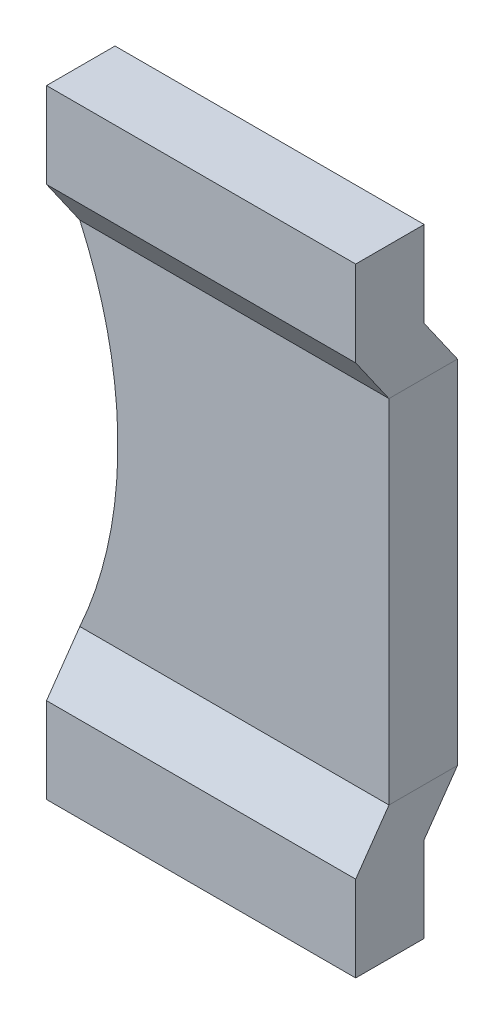
ISO-10303-21;
HEADER;
FILE_DESCRIPTION(('STEP AP214'),'2;1');
FILE_NAME('part.step','',(''),(''),'','','');
FILE_SCHEMA(('AUTOMOTIVE_DESIGN { 1 0 10303 214 1 1 1 1 }'));
ENDSEC;
DATA;
#1=APPLICATION_CONTEXT('core data for automotive mechanical design processes');
#2=APPLICATION_PROTOCOL_DEFINITION('international standard','automotive_design',2000,#1);
#3=PRODUCT_CONTEXT('',#1,'mechanical');
#4=PRODUCT('Part','Part','',(#3));
#5=PRODUCT_RELATED_PRODUCT_CATEGORY('part','',(#4));
#6=PRODUCT_DEFINITION_FORMATION('','',#4);
#7=PRODUCT_DEFINITION_CONTEXT('part definition',#1,'design');
#8=PRODUCT_DEFINITION('design','',#6,#7);
#9=PRODUCT_DEFINITION_SHAPE('','',#8);
#10=(LENGTH_UNIT() NAMED_UNIT(*) SI_UNIT(.MILLI.,.METRE.));
#11=(NAMED_UNIT(*) PLANE_ANGLE_UNIT() SI_UNIT($,.RADIAN.));
#12=(NAMED_UNIT(*) SI_UNIT($,.STERADIAN.) SOLID_ANGLE_UNIT());
#13=UNCERTAINTY_MEASURE_WITH_UNIT(LENGTH_MEASURE(1.E-05),#10,'distance_accuracy_value','');
#14=(GEOMETRIC_REPRESENTATION_CONTEXT(3) GLOBAL_UNCERTAINTY_ASSIGNED_CONTEXT((#13)) GLOBAL_UNIT_ASSIGNED_CONTEXT((#10,
#11,#12)) REPRESENTATION_CONTEXT('',''));
#15=CARTESIAN_POINT('',(0.,0.,0.));
#16=DIRECTION('',(0.,0.,1.));
#17=DIRECTION('',(1.,0.,0.));
#18=AXIS2_PLACEMENT_3D('',#15,#16,#17);
#19=CARTESIAN_POINT('',(-29.0178003146851,-15.9691002559616,-0.547780244336323));
#20=DIRECTION('',(-1.,1.192487681713E-08,4.37114101724698E-08));
#21=DIRECTION('',(1.19248806384999E-08,1.,8.74227339409094E-08));
#22=AXIS2_PLACEMENT_3D('',#19,#20,#21);
#23=PLANE('',#22);
#24=DIRECTION('',(1.53035439237163E-08,-0.819152094432634,0.573576364738498));
#25=VECTOR('',#24,1.);
#26=CARTESIAN_POINT('',(-29.0178003350904,-15.7191743080104,-1.08278022248711));
#27=LINE('',#26,#25);
#28=CARTESIAN_POINT('',(-29.0178003350904,-15.7191743080104,-1.08278022248711));
#29=VERTEX_POINT('',#28);
#30=CARTESIAN_POINT('',(-29.0178003257521,-16.2190261409684,-0.732780266185528));
#31=VERTEX_POINT('',#30);
#32=EDGE_CURVE('P0_E96',#29,#31,#27,.T.);
#33=ORIENTED_EDGE('',*,*,#32,.F.);
#34=DIRECTION('',(-4.37114091299643E-08,8.74227344621626E-08,-1.));
#35=VECTOR('',#34,1.);
#36=CARTESIAN_POINT('',(-29.0178003036182,-15.7191743709548,-0.362780222487118));
#37=LINE('',#36,#35);
#38=CARTESIAN_POINT('',(-29.0178003036182,-15.7191743709548,-0.362780222487118));
#39=VERTEX_POINT('',#38);
#40=EDGE_CURVE('P0_E82',#39,#29,#37,.T.);
#41=ORIENTED_EDGE('',*,*,#40,.F.);
#42=DIRECTION('',(-1.53035439237163E-08,0.819152094432634,-0.573576364738498));
#43=VECTOR('',#42,1.);
#44=CARTESIAN_POINT('',(-29.0178002942799,-16.2190262039127,-0.0127802661855298));
#45=LINE('',#44,#43);
#46=CARTESIAN_POINT('',(-29.0178002942799,-16.2190262039127,-0.0127802661855298));
#47=VERTEX_POINT('',#46);
#48=EDGE_CURVE('P0_E27',#47,#39,#45,.T.);
#49=ORIENTED_EDGE('',*,*,#48,.F.);
#50=DIRECTION('',(1.19248806384999E-08,1.,8.74227339409094E-08));
#51=VECTOR('',#50,1.);
#52=CARTESIAN_POINT('',(-29.0178003050123,-17.1190262039127,-0.0127803448659904));
#53=LINE('',#52,#51);
#54=CARTESIAN_POINT('',(-29.0178003050123,-17.1190262039127,-0.0127803448659904));
#55=VERTEX_POINT('',#54);
#56=EDGE_CURVE('P0_E136',#55,#47,#53,.T.);
#57=ORIENTED_EDGE('',*,*,#56,.F.);
#58=DIRECTION('',(4.37114091299643E-08,-8.74227344621626E-08,1.));
#59=VECTOR('',#58,1.);
#60=CARTESIAN_POINT('',(-29.0178003364845,-17.1190261409684,-0.732780344865988));
#61=LINE('',#60,#59);
#62=CARTESIAN_POINT('',(-29.0178003364845,-17.1190261409684,-0.732780344865988));
#63=VERTEX_POINT('',#62);
#64=EDGE_CURVE('P0_E142',#63,#55,#61,.T.);
#65=ORIENTED_EDGE('',*,*,#64,.F.);
#66=DIRECTION('',(-1.19248806384999E-08,-1.,-8.74227339409094E-08));
#67=VECTOR('',#66,1.);
#68=CARTESIAN_POINT('',(-29.0178003257521,-16.2190261409684,-0.732780266185528));
#69=LINE('',#68,#67);
#70=EDGE_CURVE('P0_E110',#31,#63,#69,.T.);
#71=ORIENTED_EDGE('',*,*,#70,.F.);
#72=EDGE_LOOP('',(#33,#41,#49,#57,#65,#71));
#73=FACE_BOUND('',#72,.T.);
#74=ADVANCED_FACE('P0_F17',(#73),#23,.F.);
#75=CARTESIAN_POINT('',(-32.2678003146851,-15.9691002172057,-0.54778010227424));
#76=DIRECTION('',(-1.,1.192487681713E-08,4.37114101724698E-08));
#77=DIRECTION('',(1.19248806384999E-08,1.,8.74227339409094E-08));
#78=AXIS2_PLACEMENT_3D('',#75,#76,#77);
#79=PLANE('',#78);
#80=DIRECTION('',(-1.53035439237163E-08,0.819152094432634,-0.573576364738498));
#81=VECTOR('',#80,1.);
#82=CARTESIAN_POINT('',(-32.2678002942799,-16.2190261651569,-0.0127801241234468));
#83=LINE('',#82,#81);
#84=CARTESIAN_POINT('',(-32.2678002942799,-16.2190261651569,-0.0127801241234468));
#85=VERTEX_POINT('',#84);
#86=CARTESIAN_POINT('',(-32.2678003036182,-15.7191743321989,-0.362780080425035));
#87=VERTEX_POINT('',#86);
#88=EDGE_CURVE('P0_E11',#85,#87,#83,.T.);
#89=ORIENTED_EDGE('',*,*,#88,.T.);
#90=DIRECTION('',(-4.37114091299643E-08,8.74227344621626E-08,-1.));
#91=VECTOR('',#90,1.);
#92=CARTESIAN_POINT('',(-32.2678003036182,-15.7191743321989,-0.362780080425035));
#93=LINE('',#92,#91);
#94=CARTESIAN_POINT('',(-32.2678003350904,-15.7191742692546,-1.08278008042503));
#95=VERTEX_POINT('',#94);
#96=EDGE_CURVE('P0_E75',#87,#95,#93,.T.);
#97=ORIENTED_EDGE('',*,*,#96,.T.);
#98=DIRECTION('',(1.53035439237163E-08,-0.819152094432634,0.573576364738498));
#99=VECTOR('',#98,1.);
#100=CARTESIAN_POINT('',(-32.2678003350904,-15.7191742692546,-1.08278008042503));
#101=LINE('',#100,#99);
#102=CARTESIAN_POINT('',(-32.2678003257521,-16.2190261022125,-0.732780124123444));
#103=VERTEX_POINT('',#102);
#104=EDGE_CURVE('P0_E63',#95,#103,#101,.T.);
#105=ORIENTED_EDGE('',*,*,#104,.T.);
#106=DIRECTION('',(-1.19248806384999E-08,-1.,-8.74227339409094E-08));
#107=VECTOR('',#106,1.);
#108=CARTESIAN_POINT('',(-32.2678003257521,-16.2190261022125,-0.732780124123444));
#109=LINE('',#108,#107);
#110=CARTESIAN_POINT('',(-32.2678003364844,-17.1190261022126,-0.732780202803905));
#111=VERTEX_POINT('',#110);
#112=EDGE_CURVE('P0_E107',#103,#111,#109,.T.);
#113=ORIENTED_EDGE('',*,*,#112,.T.);
#114=DIRECTION('',(4.37114091299643E-08,-8.74227344621626E-08,1.));
#115=VECTOR('',#114,1.);
#116=CARTESIAN_POINT('',(-32.2678003364844,-17.1190261022126,-0.732780202803905));
#117=LINE('',#116,#115);
#118=CARTESIAN_POINT('',(-32.2678003050123,-17.1190261651569,-0.0127802028039073));
#119=VERTEX_POINT('',#118);
#120=EDGE_CURVE('P0_E113',#111,#119,#117,.T.);
#121=ORIENTED_EDGE('',*,*,#120,.T.);
#122=DIRECTION('',(1.19248806384999E-08,1.,8.74227339409094E-08));
#123=VECTOR('',#122,1.);
#124=CARTESIAN_POINT('',(-32.2678003050123,-17.1190261651569,-0.0127802028039073));
#125=LINE('',#124,#123);
#126=EDGE_CURVE('P0_E100',#119,#85,#125,.T.);
#127=ORIENTED_EDGE('',*,*,#126,.T.);
#128=EDGE_LOOP('',(#89,#97,#105,#113,#121,#127));
#129=FACE_BOUND('',#128,.T.);
#130=ADVANCED_FACE('P0_F77',(#129),#79,.T.);
#131=CARTESIAN_POINT('',(-29.0178002942799,-16.2190262039127,-0.0127802661855298));
#132=DIRECTION('',(4.26461206881058E-08,0.573576364738498,0.819152094432634));
#133=DIRECTION('',(-1.53035439237163E-08,0.819152094432634,-0.573576364738498));
#134=AXIS2_PLACEMENT_3D('',#131,#132,#133);
#135=PLANE('',#134);
#136=ORIENTED_EDGE('',*,*,#48,.T.);
#137=DIRECTION('',(-1.,1.192487681713E-08,4.37114101724698E-08));
#138=VECTOR('',#137,1.);
#139=CARTESIAN_POINT('',(-29.0178003036182,-15.7191743709548,-0.362780222487118));
#140=LINE('',#139,#138);
#141=EDGE_CURVE('P0_E81',#39,#87,#140,.T.);
#142=ORIENTED_EDGE('',*,*,#141,.T.);
#143=ORIENTED_EDGE('',*,*,#88,.F.);
#144=DIRECTION('',(-1.,1.192487681713E-08,4.37114101724698E-08));
#145=VECTOR('',#144,1.);
#146=CARTESIAN_POINT('',(-29.0178002942799,-16.2190262039127,-0.0127802661855298));
#147=LINE('',#146,#145);
#148=EDGE_CURVE('P0_E123',#47,#85,#147,.T.);
#149=ORIENTED_EDGE('',*,*,#148,.F.);
#150=EDGE_LOOP('',(#136,#142,#143,#149));
#151=FACE_BOUND('',#150,.T.);
#152=ADVANCED_FACE('P0_F190',(#151),#135,.T.);
#153=CARTESIAN_POINT('',(-29.0178003036182,-15.7191743709548,-0.362780222487118));
#154=DIRECTION('',(1.19248806384999E-08,1.,8.74227339409094E-08));
#155=DIRECTION('',(-4.37114091299643E-08,8.74227344621626E-08,-1.));
#156=AXIS2_PLACEMENT_3D('',#153,#154,#155);
#157=PLANE('',#156);
#158=ORIENTED_EDGE('',*,*,#40,.T.);
#159=DIRECTION('',(-1.,1.192487681713E-08,4.37114101724698E-08));
#160=VECTOR('',#159,1.);
#161=CARTESIAN_POINT('',(-29.0178003350904,-15.7191743080104,-1.08278022248711));
#162=LINE('',#161,#160);
#163=EDGE_CURVE('P0_E85',#29,#95,#162,.T.);
#164=ORIENTED_EDGE('',*,*,#163,.T.);
#165=ORIENTED_EDGE('',*,*,#96,.F.);
#166=ORIENTED_EDGE('',*,*,#141,.F.);
#167=EDGE_LOOP('',(#158,#164,#165,#166));
#168=FACE_BOUND('',#167,.T.);
#169=ADVANCED_FACE('P0_F86',(#168),#157,.T.);
#170=CARTESIAN_POINT('',(-29.0178003350904,-15.7191743080104,-1.08278022248711));
#171=DIRECTION('',(-4.26461206881058E-08,-0.573576364738498,-0.819152094432634));
#172=DIRECTION('',(1.53035439237163E-08,-0.819152094432634,0.573576364738498));
#173=AXIS2_PLACEMENT_3D('',#170,#171,#172);
#174=PLANE('',#173);
#175=ORIENTED_EDGE('',*,*,#32,.T.);
#176=DIRECTION('',(-1.,1.192487681713E-08,4.37114101724698E-08));
#177=VECTOR('',#176,1.);
#178=CARTESIAN_POINT('',(-29.0178003257521,-16.2190261409684,-0.732780266185528));
#179=LINE('',#178,#177);
#180=EDGE_CURVE('P0_E93',#31,#103,#179,.T.);
#181=ORIENTED_EDGE('',*,*,#180,.T.);
#182=ORIENTED_EDGE('',*,*,#104,.F.);
#183=ORIENTED_EDGE('',*,*,#163,.F.);
#184=EDGE_LOOP('',(#175,#181,#182,#183));
#185=FACE_BOUND('',#184,.T.);
#186=ADVANCED_FACE('P0_F91',(#185),#174,.T.);
#187=CARTESIAN_POINT('',(-29.0178003050123,-17.1190262039127,-0.0127803448659904));
#188=DIRECTION('',(4.37114091299643E-08,-8.74227344621626E-08,1.));
#189=DIRECTION('',(1.19248806384999E-08,1.,8.74227339409094E-08));
#190=AXIS2_PLACEMENT_3D('',#187,#188,#189);
#191=PLANE('',#190);
#192=ORIENTED_EDGE('',*,*,#56,.T.);
#193=ORIENTED_EDGE('',*,*,#148,.T.);
#194=ORIENTED_EDGE('',*,*,#126,.F.);
#195=DIRECTION('',(-1.,1.192487681713E-08,4.37114101724698E-08));
#196=VECTOR('',#195,1.);
#197=CARTESIAN_POINT('',(-29.0178003050123,-17.1190262039127,-0.0127803448659904));
#198=LINE('',#197,#196);
#199=EDGE_CURVE('P0_E118',#55,#119,#198,.T.);
#200=ORIENTED_EDGE('',*,*,#199,.F.);
#201=EDGE_LOOP('',(#192,#193,#194,#200));
#202=FACE_BOUND('',#201,.T.);
#203=ADVANCED_FACE('P0_F186',(#202),#191,.T.);
#204=CARTESIAN_POINT('',(-29.0178003257521,-16.2190261409684,-0.732780266185528));
#205=DIRECTION('',(-4.37114091299643E-08,8.74227344621626E-08,-1.));
#206=DIRECTION('',(-1.19248806384999E-08,-1.,-8.74227339409094E-08));
#207=AXIS2_PLACEMENT_3D('',#204,#205,#206);
#208=PLANE('',#207);
#209=ORIENTED_EDGE('',*,*,#70,.T.);
#210=DIRECTION('',(-1.,1.192487681713E-08,4.37114101724698E-08));
#211=VECTOR('',#210,1.);
#212=CARTESIAN_POINT('',(-29.0178003364845,-17.1190261409684,-0.732780344865988));
#213=LINE('',#212,#211);
#214=EDGE_CURVE('P0_E117',#63,#111,#213,.T.);
#215=ORIENTED_EDGE('',*,*,#214,.T.);
#216=ORIENTED_EDGE('',*,*,#112,.F.);
#217=ORIENTED_EDGE('',*,*,#180,.F.);
#218=EDGE_LOOP('',(#209,#215,#216,#217));
#219=FACE_BOUND('',#218,.T.);
#220=ADVANCED_FACE('P0_F215',(#219),#208,.T.);
#221=CARTESIAN_POINT('',(-29.0178003364845,-17.1190261409684,-0.732780344865988));
#222=DIRECTION('',(-1.19248806384999E-08,-1.,-8.74227339409094E-08));
#223=DIRECTION('',(4.37114091299643E-08,-8.74227344621626E-08,1.));
#224=AXIS2_PLACEMENT_3D('',#221,#222,#223);
#225=PLANE('',#224);
#226=ORIENTED_EDGE('',*,*,#64,.T.);
#227=ORIENTED_EDGE('',*,*,#199,.T.);
#228=ORIENTED_EDGE('',*,*,#120,.F.);
#229=ORIENTED_EDGE('',*,*,#214,.F.);
#230=EDGE_LOOP('',(#226,#227,#228,#229));
#231=FACE_BOUND('',#230,.T.);
#232=ADVANCED_FACE('P0_F194',(#231),#225,.T.);
#233=CLOSED_SHELL('',(#74,#130,#152,#169,#186,#203,#220,#232));
#234=MANIFOLD_SOLID_BREP('P0_B1',#233);
#235=CARTESIAN_POINT('',(-29.0178002645989,-11.7689520583216,-0.547779877147884));
#236=DIRECTION('',(-1.,1.192487681713E-08,4.37114101724698E-08));
#237=DIRECTION('',(1.19248806384999E-08,1.,8.74227339409094E-08));
#238=AXIS2_PLACEMENT_3D('',#235,#236,#237);
#239=PLANE('',#238);
#240=DIRECTION('',(-3.48401246295757E-08,-0.819151994145393,-0.57357650796352));
#241=VECTOR('',#240,1.);
#242=CARTESIAN_POINT('',(-29.0178002697052,-11.5190261409684,-0.732779855298678));
#243=LINE('',#242,#241);
#244=CARTESIAN_POINT('',(-29.0178002697052,-11.5190261409684,-0.732779855298678));
#245=VERTEX_POINT('',#244);
#246=CARTESIAN_POINT('',(-29.0178002909648,-12.0188779127304,-1.08277989899709));
#247=VERTEX_POINT('',#246);
#248=EDGE_CURVE('P1_E27',#245,#247,#243,.T.);
#249=ORIENTED_EDGE('',*,*,#248,.F.);
#250=DIRECTION('',(-1.19248806384999E-08,-1.,-8.74227339409094E-08));
#251=VECTOR('',#250,1.);
#252=CARTESIAN_POINT('',(-29.0178002589727,-10.6190261409684,-0.732779776618218));
#253=LINE('',#252,#251);
#254=CARTESIAN_POINT('',(-29.0178002589727,-10.6190261409684,-0.732779776618218));
#255=VERTEX_POINT('',#254);
#256=EDGE_CURVE('P1_E147',#255,#245,#253,.T.);
#257=ORIENTED_EDGE('',*,*,#256,.F.);
#258=DIRECTION('',(-4.37114091299643E-08,8.74227344621626E-08,-1.));
#259=VECTOR('',#258,1.);
#260=CARTESIAN_POINT('',(-29.0178002275006,-10.6190262039128,-0.0127797766182199));
#261=LINE('',#260,#259);
#262=CARTESIAN_POINT('',(-29.0178002275006,-10.6190262039128,-0.0127797766182199));
#263=VERTEX_POINT('',#262);
#264=EDGE_CURVE('P1_E65',#263,#255,#261,.T.);
#265=ORIENTED_EDGE('',*,*,#264,.F.);
#266=DIRECTION('',(1.19248806384999E-08,1.,8.74227339409094E-08));
#267=VECTOR('',#266,1.);
#268=CARTESIAN_POINT('',(-29.0178002382329,-11.5190262039128,-0.0127798552986805));
#269=LINE('',#268,#267);
#270=CARTESIAN_POINT('',(-29.0178002382329,-11.5190262039128,-0.0127798552986805));
#271=VERTEX_POINT('',#270);
#272=EDGE_CURVE('P1_E157',#271,#263,#269,.T.);
#273=ORIENTED_EDGE('',*,*,#272,.F.);
#274=DIRECTION('',(3.48401246295757E-08,0.819151994145393,0.57357650796352));
#275=VECTOR('',#274,1.);
#276=CARTESIAN_POINT('',(-29.0178002594926,-12.0188779756748,-0.362779898997091));
#277=LINE('',#276,#275);
#278=CARTESIAN_POINT('',(-29.0178002594926,-12.0188779756748,-0.362779898997091));
#279=VERTEX_POINT('',#278);
#280=EDGE_CURVE('P1_E115',#279,#271,#277,.T.);
#281=ORIENTED_EDGE('',*,*,#280,.F.);
#282=DIRECTION('',(4.37114091299643E-08,-8.74227344621626E-08,1.));
#283=VECTOR('',#282,1.);
#284=CARTESIAN_POINT('',(-29.0178002909648,-12.0188779127304,-1.08277989899709));
#285=LINE('',#284,#283);
#286=EDGE_CURVE('P1_E101',#247,#279,#285,.T.);
#287=ORIENTED_EDGE('',*,*,#286,.F.);
#288=EDGE_LOOP('',(#249,#257,#265,#273,#281,#287));
#289=FACE_BOUND('',#288,.T.);
#290=ADVANCED_FACE('P1_F17',(#289),#239,.F.);
#291=CARTESIAN_POINT('',(-32.2678002645988,-11.7689520195658,-0.547779735085801));
#292=DIRECTION('',(-1.,1.192487681713E-08,4.37114101724698E-08));
#293=DIRECTION('',(1.19248806384999E-08,1.,8.74227339409094E-08));
#294=AXIS2_PLACEMENT_3D('',#291,#292,#293);
#295=PLANE('',#294);
#296=DIRECTION('',(-3.48401246295757E-08,-0.819151994145393,-0.57357650796352));
#297=VECTOR('',#296,1.);
#298=CARTESIAN_POINT('',(-32.2678002697051,-11.5190261022126,-0.732779713236595));
#299=LINE('',#298,#297);
#300=CARTESIAN_POINT('',(-32.2678002697051,-11.5190261022126,-0.732779713236595));
#301=VERTEX_POINT('',#300);
#302=CARTESIAN_POINT('',(-32.2678002909648,-12.0188778739746,-1.082779756935));
#303=VERTEX_POINT('',#302);
#304=EDGE_CURVE('P1_E11',#301,#303,#299,.T.);
#305=ORIENTED_EDGE('',*,*,#304,.T.);
#306=DIRECTION('',(4.37114091299643E-08,-8.74227344621626E-08,1.));
#307=VECTOR('',#306,1.);
#308=CARTESIAN_POINT('',(-32.2678002909648,-12.0188778739746,-1.082779756935));
#309=LINE('',#308,#307);
#310=CARTESIAN_POINT('',(-32.2678002594926,-12.018877936919,-0.362779756935007));
#311=VERTEX_POINT('',#310);
#312=EDGE_CURVE('P1_E90',#303,#311,#309,.T.);
#313=ORIENTED_EDGE('',*,*,#312,.T.);
#314=DIRECTION('',(3.48401246295757E-08,0.819151994145393,0.57357650796352));
#315=VECTOR('',#314,1.);
#316=CARTESIAN_POINT('',(-32.2678002594926,-12.018877936919,-0.362779756935007));
#317=LINE('',#316,#315);
#318=CARTESIAN_POINT('',(-32.2678002382329,-11.5190261651569,-0.012779713236597));
#319=VERTEX_POINT('',#318);
#320=EDGE_CURVE('P1_E95',#311,#319,#317,.T.);
#321=ORIENTED_EDGE('',*,*,#320,.T.);
#322=DIRECTION('',(1.19248806384999E-08,1.,8.74227339409094E-08));
#323=VECTOR('',#322,1.);
#324=CARTESIAN_POINT('',(-32.2678002382329,-11.5190261651569,-0.012779713236597));
#325=LINE('',#324,#323);
#326=CARTESIAN_POINT('',(-32.2678002275005,-10.6190261651569,-0.0127796345561369));
#327=VERTEX_POINT('',#326);
#328=EDGE_CURVE('P1_E126',#319,#327,#325,.T.);
#329=ORIENTED_EDGE('',*,*,#328,.T.);
#330=DIRECTION('',(-4.37114091299643E-08,8.74227344621626E-08,-1.));
#331=VECTOR('',#330,1.);
#332=CARTESIAN_POINT('',(-32.2678002275005,-10.6190261651569,-0.0127796345561369));
#333=LINE('',#332,#331);
#334=CARTESIAN_POINT('',(-32.2678002589728,-10.6190261022126,-0.732779634556134));
#335=VERTEX_POINT('',#334);
#336=EDGE_CURVE('P1_E119',#327,#335,#333,.T.);
#337=ORIENTED_EDGE('',*,*,#336,.T.);
#338=DIRECTION('',(-1.19248806384999E-08,-1.,-8.74227339409094E-08));
#339=VECTOR('',#338,1.);
#340=CARTESIAN_POINT('',(-32.2678002589728,-10.6190261022126,-0.732779634556134));
#341=LINE('',#340,#339);
#342=EDGE_CURVE('P1_E136',#335,#301,#341,.T.);
#343=ORIENTED_EDGE('',*,*,#342,.T.);
#344=EDGE_LOOP('',(#305,#313,#321,#329,#337,#343));
#345=FACE_BOUND('',#344,.T.);
#346=ADVANCED_FACE('P1_F92',(#345),#295,.T.);
#347=CARTESIAN_POINT('',(-29.0178002697052,-11.5190261409684,-0.732779855298678));
#348=DIRECTION('',(-2.89664596070219E-08,0.573576507963521,-0.819151994145393));
#349=DIRECTION('',(-3.48401246295757E-08,-0.819151994145393,-0.57357650796352));
#350=AXIS2_PLACEMENT_3D('',#347,#348,#349);
#351=PLANE('',#350);
#352=ORIENTED_EDGE('',*,*,#248,.T.);
#353=DIRECTION('',(-1.,1.192487681713E-08,4.37114101724698E-08));
#354=VECTOR('',#353,1.);
#355=CARTESIAN_POINT('',(-29.0178002909648,-12.0188779127304,-1.08277989899709));
#356=LINE('',#355,#354);
#357=EDGE_CURVE('P1_E100',#247,#303,#356,.T.);
#358=ORIENTED_EDGE('',*,*,#357,.T.);
#359=ORIENTED_EDGE('',*,*,#304,.F.);
#360=DIRECTION('',(-1.,1.192487681713E-08,4.37114101724698E-08));
#361=VECTOR('',#360,1.);
#362=CARTESIAN_POINT('',(-29.0178002697052,-11.5190261409684,-0.732779855298678));
#363=LINE('',#362,#361);
#364=EDGE_CURVE('P1_E140',#245,#301,#363,.T.);
#365=ORIENTED_EDGE('',*,*,#364,.F.);
#366=EDGE_LOOP('',(#352,#358,#359,#365));
#367=FACE_BOUND('',#366,.T.);
#368=ADVANCED_FACE('P1_F195',(#367),#351,.T.);
#369=CARTESIAN_POINT('',(-29.0178002909648,-12.0188779127304,-1.08277989899709));
#370=DIRECTION('',(-1.19248806384999E-08,-1.,-8.74227339409094E-08));
#371=DIRECTION('',(4.37114091299643E-08,-8.74227344621626E-08,1.));
#372=AXIS2_PLACEMENT_3D('',#369,#370,#371);
#373=PLANE('',#372);
#374=ORIENTED_EDGE('',*,*,#286,.T.);
#375=DIRECTION('',(-1.,1.192487681713E-08,4.37114101724698E-08));
#376=VECTOR('',#375,1.);
#377=CARTESIAN_POINT('',(-29.0178002594926,-12.0188779756748,-0.362779898997091));
#378=LINE('',#377,#376);
#379=EDGE_CURVE('P1_E104',#279,#311,#378,.T.);
#380=ORIENTED_EDGE('',*,*,#379,.T.);
#381=ORIENTED_EDGE('',*,*,#312,.F.);
#382=ORIENTED_EDGE('',*,*,#357,.F.);
#383=EDGE_LOOP('',(#374,#380,#381,#382));
#384=FACE_BOUND('',#383,.T.);
#385=ADVANCED_FACE('P1_F105',(#384),#373,.T.);
#386=CARTESIAN_POINT('',(-29.0178002594926,-12.0188779756748,-0.362779898997091));
#387=DIRECTION('',(2.89664596070219E-08,-0.573576507963521,0.819151994145393));
#388=DIRECTION('',(3.48401246295757E-08,0.819151994145393,0.57357650796352));
#389=AXIS2_PLACEMENT_3D('',#386,#387,#388);
#390=PLANE('',#389);
#391=ORIENTED_EDGE('',*,*,#280,.T.);
#392=DIRECTION('',(-1.,1.192487681713E-08,4.37114101724698E-08));
#393=VECTOR('',#392,1.);
#394=CARTESIAN_POINT('',(-29.0178002382329,-11.5190262039128,-0.0127798552986805));
#395=LINE('',#394,#393);
#396=EDGE_CURVE('P1_E112',#271,#319,#395,.T.);
#397=ORIENTED_EDGE('',*,*,#396,.T.);
#398=ORIENTED_EDGE('',*,*,#320,.F.);
#399=ORIENTED_EDGE('',*,*,#379,.F.);
#400=EDGE_LOOP('',(#391,#397,#398,#399));
#401=FACE_BOUND('',#400,.T.);
#402=ADVANCED_FACE('P1_F110',(#401),#390,.T.);
#403=CARTESIAN_POINT('',(-29.0178002275006,-10.6190262039128,-0.0127797766182199));
#404=DIRECTION('',(1.19248806384999E-08,1.,8.74227339409094E-08));
#405=DIRECTION('',(-4.37114091299643E-08,8.74227344621626E-08,-1.));
#406=AXIS2_PLACEMENT_3D('',#403,#404,#405);
#407=PLANE('',#406);
#408=ORIENTED_EDGE('',*,*,#264,.T.);
#409=DIRECTION('',(-1.,1.192487681713E-08,4.37114101724698E-08));
#410=VECTOR('',#409,1.);
#411=CARTESIAN_POINT('',(-29.0178002589727,-10.6190261409684,-0.732779776618218));
#412=LINE('',#411,#410);
#413=EDGE_CURVE('P1_E139',#255,#335,#412,.T.);
#414=ORIENTED_EDGE('',*,*,#413,.T.);
#415=ORIENTED_EDGE('',*,*,#336,.F.);
#416=DIRECTION('',(-1.,1.192487681713E-08,4.37114101724698E-08));
#417=VECTOR('',#416,1.);
#418=CARTESIAN_POINT('',(-29.0178002275006,-10.6190262039128,-0.0127797766182199));
#419=LINE('',#418,#417);
#420=EDGE_CURVE('P1_E129',#263,#327,#419,.T.);
#421=ORIENTED_EDGE('',*,*,#420,.F.);
#422=EDGE_LOOP('',(#408,#414,#415,#421));
#423=FACE_BOUND('',#422,.T.);
#424=ADVANCED_FACE('P1_F197',(#423),#407,.T.);
#425=CARTESIAN_POINT('',(-29.0178002589727,-10.6190261409684,-0.732779776618218));
#426=DIRECTION('',(-4.37114091299643E-08,8.74227344621626E-08,-1.));
#427=DIRECTION('',(-1.19248806384999E-08,-1.,-8.74227339409094E-08));
#428=AXIS2_PLACEMENT_3D('',#425,#426,#427);
#429=PLANE('',#428);
#430=ORIENTED_EDGE('',*,*,#256,.T.);
#431=ORIENTED_EDGE('',*,*,#364,.T.);
#432=ORIENTED_EDGE('',*,*,#342,.F.);
#433=ORIENTED_EDGE('',*,*,#413,.F.);
#434=EDGE_LOOP('',(#430,#431,#432,#433));
#435=FACE_BOUND('',#434,.T.);
#436=ADVANCED_FACE('P1_F194',(#435),#429,.T.);
#437=CARTESIAN_POINT('',(-29.0178002382329,-11.5190262039128,-0.0127798552986805));
#438=DIRECTION('',(4.37114091299643E-08,-8.74227344621626E-08,1.));
#439=DIRECTION('',(1.19248806384999E-08,1.,8.74227339409094E-08));
#440=AXIS2_PLACEMENT_3D('',#437,#438,#439);
#441=PLANE('',#440);
#442=ORIENTED_EDGE('',*,*,#272,.T.);
#443=ORIENTED_EDGE('',*,*,#420,.T.);
#444=ORIENTED_EDGE('',*,*,#328,.F.);
#445=ORIENTED_EDGE('',*,*,#396,.F.);
#446=EDGE_LOOP('',(#442,#443,#444,#445));
#447=FACE_BOUND('',#446,.T.);
#448=ADVANCED_FACE('P1_F268',(#447),#441,.T.);
#449=CLOSED_SHELL('',(#290,#346,#368,#385,#402,#424,#436,#448));
#450=MANIFOLD_SOLID_BREP('P1_B1',#449);
#451=CARTESIAN_POINT('',(-29.0178002972915,-13.8690261418426,-0.722780060742103));
#452=DIRECTION('',(1.,-1.192487681713E-08,-4.37114101724698E-08));
#453=DIRECTION('',(-1.19248806384999E-08,-1.,-8.74227339409094E-08));
#454=AXIS2_PLACEMENT_3D('',#451,#452,#453);
#455=PLANE('',#454);
#456=DIRECTION('',(1.19248806384999E-08,1.,8.74227339409094E-08));
#457=VECTOR('',#456,1.);
#458=CARTESIAN_POINT('',(-29.0178003350904,-15.7191743080104,-1.08278022248711));
#459=LINE('',#458,#457);
#460=CARTESIAN_POINT('',(-29.0178003350904,-15.7191743080104,-1.08278022248711));
#461=VERTEX_POINT('',#460);
#462=CARTESIAN_POINT('',(-29.0178002909648,-12.0188779127304,-1.08277989899709));
#463=VERTEX_POINT('',#462);
#464=EDGE_CURVE('P2_E11',#461,#463,#459,.T.);
#465=ORIENTED_EDGE('',*,*,#464,.T.);
#466=DIRECTION('',(4.37114091299643E-08,-8.74227344621626E-08,1.));
#467=VECTOR('',#466,1.);
#468=CARTESIAN_POINT('',(-29.0178002909648,-12.0188779127304,-1.08277989899709));
#469=LINE('',#468,#467);
#470=CARTESIAN_POINT('',(-29.0178002594926,-12.0188779756748,-0.362779898997091));
#471=VERTEX_POINT('',#470);
#472=EDGE_CURVE('P2_E118',#463,#471,#469,.T.);
#473=ORIENTED_EDGE('',*,*,#472,.T.);
#474=DIRECTION('',(-1.19248806384999E-08,-1.,-8.74227339409094E-08));
#475=VECTOR('',#474,1.);
#476=CARTESIAN_POINT('',(-29.0178002594926,-12.0188779756748,-0.362779898997091));
#477=LINE('',#476,#475);
#478=CARTESIAN_POINT('',(-29.0178003036182,-15.7191743709548,-0.362780222487118));
#479=VERTEX_POINT('',#478);
#480=EDGE_CURVE('P2_E73',#471,#479,#477,.T.);
#481=ORIENTED_EDGE('',*,*,#480,.T.);
#482=DIRECTION('',(-4.37114091299643E-08,8.74227344621626E-08,-1.));
#483=VECTOR('',#482,1.);
#484=CARTESIAN_POINT('',(-29.0178003036182,-15.7191743709548,-0.362780222487118));
#485=LINE('',#484,#483);
#486=EDGE_CURVE('P2_E124',#479,#461,#485,.T.);
#487=ORIENTED_EDGE('',*,*,#486,.T.);
#488=EDGE_LOOP('',(#465,#473,#481,#487));
#489=FACE_BOUND('',#488,.T.);
#490=ADVANCED_FACE('P2_F17',(#489),#455,.T.);
#491=CARTESIAN_POINT('',(-32.2678003350904,-15.7191742692546,-1.08278008042503));
#492=DIRECTION('',(-4.37114091299643E-08,8.74227344621626E-08,-1.));
#493=DIRECTION('',(1.19248806384999E-08,1.,8.74227339409094E-08));
#494=AXIS2_PLACEMENT_3D('',#491,#492,#493);
#495=PLANE('',#494);
#496=CARTESIAN_POINT('',(-36.3466107545666,-13.8690260229753,-1.08277974038946));
#497=DIRECTION('',(4.37114091299643E-08,-8.74227344621626E-08,1.));
#498=DIRECTION('',(0.910690576625632,0.413089183645943,-3.69418237461545E-09));
#499=AXIS2_PLACEMENT_3D('',#496,#497,#498);
#500=CIRCLE('',#499,4.478810441539);
#501=CARTESIAN_POINT('',(-32.2678003350904,-15.7191742692546,-1.08278008042503));
#502=VERTEX_POINT('',#501);
#503=CARTESIAN_POINT('',(-32.2678002909648,-12.0188778739746,-1.082779756935));
#504=VERTEX_POINT('',#503);
#505=EDGE_CURVE('P2_E86',#502,#504,#500,.T.);
#506=ORIENTED_EDGE('',*,*,#505,.T.);
#507=DIRECTION('',(1.,-1.192487681713E-08,-4.37114101724698E-08));
#508=VECTOR('',#507,1.);
#509=CARTESIAN_POINT('',(-32.2678002909648,-12.0188778739746,-1.082779756935));
#510=LINE('',#509,#508);
#511=EDGE_CURVE('P2_E27',#504,#463,#510,.T.);
#512=ORIENTED_EDGE('',*,*,#511,.T.);
#513=ORIENTED_EDGE('',*,*,#464,.F.);
#514=DIRECTION('',(1.,-1.192487681713E-08,-4.37114101724698E-08));
#515=VECTOR('',#514,1.);
#516=CARTESIAN_POINT('',(-32.2678003350904,-15.7191742692546,-1.08278008042503));
#517=LINE('',#516,#515);
#518=EDGE_CURVE('P2_E77',#502,#461,#517,.T.);
#519=ORIENTED_EDGE('',*,*,#518,.F.);
#520=EDGE_LOOP('',(#506,#512,#513,#519));
#521=FACE_BOUND('',#520,.T.);
#522=ADVANCED_FACE('P2_F141',(#521),#495,.T.);
#523=CARTESIAN_POINT('',(-32.2678002909648,-12.0188778739746,-1.082779756935));
#524=DIRECTION('',(1.19248806384999E-08,1.,8.74227339409094E-08));
#525=DIRECTION('',(4.37114091299643E-08,-8.74227344621626E-08,1.));
#526=AXIS2_PLACEMENT_3D('',#523,#524,#525);
#527=PLANE('',#526);
#528=DIRECTION('',(4.37114091299643E-08,-8.74227344621626E-08,1.));
#529=VECTOR('',#528,1.);
#530=CARTESIAN_POINT('',(-32.2678002909648,-12.0188778739746,-1.082779756935));
#531=LINE('',#530,#529);
#532=CARTESIAN_POINT('',(-32.2678002594926,-12.018877936919,-0.362779756935007));
#533=VERTEX_POINT('',#532);
#534=EDGE_CURVE('P2_E80',#504,#533,#531,.T.);
#535=ORIENTED_EDGE('',*,*,#534,.T.);
#536=DIRECTION('',(1.,-1.192487681713E-08,-4.37114101724698E-08));
#537=VECTOR('',#536,1.);
#538=CARTESIAN_POINT('',(-32.2678002594926,-12.018877936919,-0.362779756935007));
#539=LINE('',#538,#537);
#540=EDGE_CURVE('P2_E66',#533,#471,#539,.T.);
#541=ORIENTED_EDGE('',*,*,#540,.T.);
#542=ORIENTED_EDGE('',*,*,#472,.F.);
#543=ORIENTED_EDGE('',*,*,#511,.F.);
#544=EDGE_LOOP('',(#535,#541,#542,#543));
#545=FACE_BOUND('',#544,.T.);
#546=ADVANCED_FACE('P2_F81',(#545),#527,.T.);
#547=CARTESIAN_POINT('',(-32.2678003036182,-15.7191743321989,-0.362780080425035));
#548=DIRECTION('',(-1.19248806384999E-08,-1.,-8.74227339409094E-08));
#549=DIRECTION('',(-4.37114091299643E-08,8.74227344621626E-08,-1.));
#550=AXIS2_PLACEMENT_3D('',#547,#548,#549);
#551=PLANE('',#550);
#552=DIRECTION('',(-4.37114091299643E-08,8.74227344621626E-08,-1.));
#553=VECTOR('',#552,1.);
#554=CARTESIAN_POINT('',(-32.2678003036182,-15.7191743321989,-0.362780080425035));
#555=LINE('',#554,#553);
#556=CARTESIAN_POINT('',(-32.2678003036182,-15.7191743321989,-0.362780080425035));
#557=VERTEX_POINT('',#556);
#558=EDGE_CURVE('P2_E91',#557,#502,#555,.T.);
#559=ORIENTED_EDGE('',*,*,#558,.T.);
#560=ORIENTED_EDGE('',*,*,#518,.T.);
#561=ORIENTED_EDGE('',*,*,#486,.F.);
#562=DIRECTION('',(1.,-1.192487681713E-08,-4.37114101724698E-08));
#563=VECTOR('',#562,1.);
#564=CARTESIAN_POINT('',(-32.2678003036182,-15.7191743321989,-0.362780080425035));
#565=LINE('',#564,#563);
#566=EDGE_CURVE('P2_E101',#557,#479,#565,.T.);
#567=ORIENTED_EDGE('',*,*,#566,.F.);
#568=EDGE_LOOP('',(#559,#560,#561,#567));
#569=FACE_BOUND('',#568,.T.);
#570=ADVANCED_FACE('P2_F139',(#569),#551,.T.);
#571=CARTESIAN_POINT('',(-32.2678002594926,-12.018877936919,-0.362779756935007));
#572=DIRECTION('',(4.37114091299643E-08,-8.74227344621626E-08,1.));
#573=DIRECTION('',(-1.19248806384999E-08,-1.,-8.74227339409094E-08));
#574=AXIS2_PLACEMENT_3D('',#571,#572,#573);
#575=PLANE('',#574);
#576=CARTESIAN_POINT('',(-36.3466107230944,-13.8690260859196,-0.362779740389464));
#577=DIRECTION('',(-4.37114091299643E-08,8.74227344621626E-08,-1.));
#578=DIRECTION('',(0.910690576625632,0.413089183645943,-3.69418237461545E-09));
#579=AXIS2_PLACEMENT_3D('',#576,#577,#578);
#580=CIRCLE('',#579,4.478810441539);
#581=EDGE_CURVE('P2_E71',#533,#557,#580,.T.);
#582=ORIENTED_EDGE('',*,*,#581,.T.);
#583=ORIENTED_EDGE('',*,*,#566,.T.);
#584=ORIENTED_EDGE('',*,*,#480,.F.);
#585=ORIENTED_EDGE('',*,*,#540,.F.);
#586=EDGE_LOOP('',(#582,#583,#584,#585));
#587=FACE_BOUND('',#586,.T.);
#588=ADVANCED_FACE('P2_F68',(#587),#575,.T.);
#589=CARTESIAN_POINT('',(-36.3466107545666,-13.8690260229753,-1.08277974038946));
#590=DIRECTION('',(4.37114091299643E-08,-8.74227344621626E-08,1.));
#591=DIRECTION('',(0.910690576625632,0.413089183645943,-3.69418237461545E-09));
#592=AXIS2_PLACEMENT_3D('',#589,#590,#591);
#593=CYLINDRICAL_SURFACE('',#592,4.478810441539);
#594=ORIENTED_EDGE('',*,*,#581,.F.);
#595=ORIENTED_EDGE('',*,*,#534,.F.);
#596=ORIENTED_EDGE('',*,*,#505,.F.);
#597=ORIENTED_EDGE('',*,*,#558,.F.);
#598=EDGE_LOOP('',(#594,#595,#596,#597));
#599=FACE_BOUND('',#598,.T.);
#600=ADVANCED_FACE('P2_F89',(#599),#593,.F.);
#601=CLOSED_SHELL('',(#490,#522,#546,#570,#588,#600));
#602=MANIFOLD_SOLID_BREP('P2_B1',#601);
#603=ADVANCED_BREP_SHAPE_REPRESENTATION('',(#18,#234,#450,#602),#14);
#604=SHAPE_DEFINITION_REPRESENTATION(#9,#603);
ENDSEC;
END-ISO-10303-21;
